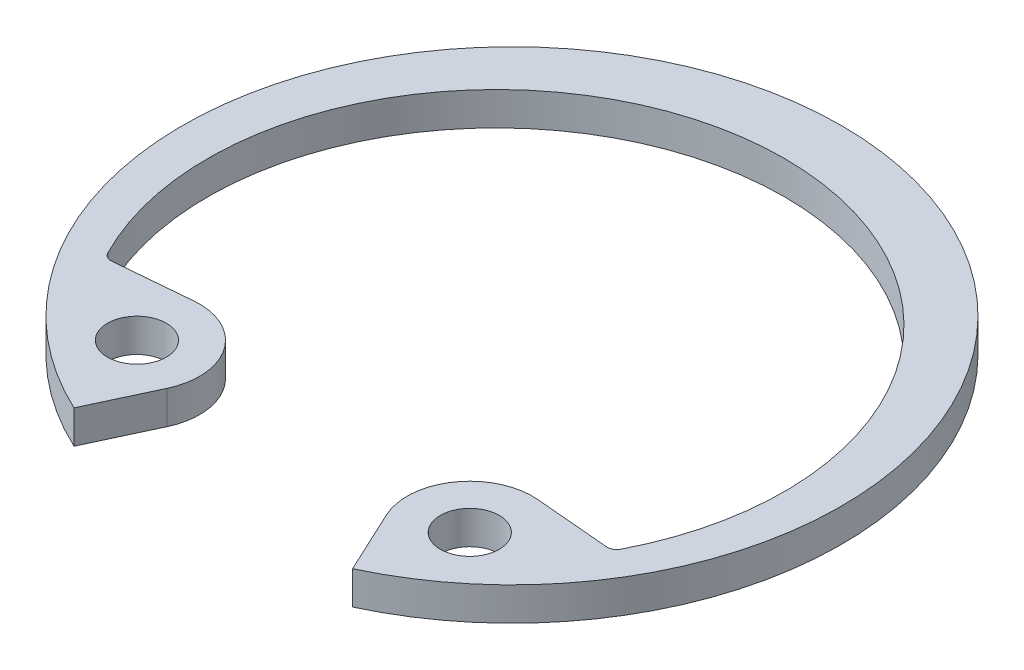
ISO-10303-21;
HEADER;
FILE_DESCRIPTION(('STEP AP214'),'2;1');
FILE_NAME('part.step','',(''),(''),'','','');
FILE_SCHEMA(('AUTOMOTIVE_DESIGN { 1 0 10303 214 1 1 1 1 }'));
ENDSEC;
DATA;
#1=APPLICATION_CONTEXT('core data for automotive mechanical design processes');
#2=APPLICATION_PROTOCOL_DEFINITION('international standard','automotive_design',2000,#1);
#3=PRODUCT_CONTEXT('',#1,'mechanical');
#4=PRODUCT('Part','Part','',(#3));
#5=PRODUCT_RELATED_PRODUCT_CATEGORY('part','',(#4));
#6=PRODUCT_DEFINITION_FORMATION('','',#4);
#7=PRODUCT_DEFINITION_CONTEXT('part definition',#1,'design');
#8=PRODUCT_DEFINITION('design','',#6,#7);
#9=PRODUCT_DEFINITION_SHAPE('','',#8);
#10=(LENGTH_UNIT() NAMED_UNIT(*) SI_UNIT(.MILLI.,.METRE.));
#11=(NAMED_UNIT(*) PLANE_ANGLE_UNIT() SI_UNIT($,.RADIAN.));
#12=(NAMED_UNIT(*) SI_UNIT($,.STERADIAN.) SOLID_ANGLE_UNIT());
#13=UNCERTAINTY_MEASURE_WITH_UNIT(LENGTH_MEASURE(1.E-05),#10,'distance_accuracy_value','');
#14=(GEOMETRIC_REPRESENTATION_CONTEXT(3) GLOBAL_UNCERTAINTY_ASSIGNED_CONTEXT((#13)) GLOBAL_UNIT_ASSIGNED_CONTEXT((#10,
#11,#12)) REPRESENTATION_CONTEXT('',''));
#15=CARTESIAN_POINT('',(0.,0.,0.));
#16=DIRECTION('',(0.,0.,1.));
#17=DIRECTION('',(1.,0.,0.));
#18=AXIS2_PLACEMENT_3D('',#15,#16,#17);
#19=CARTESIAN_POINT('',(4.45134772404972,-0.889,5.57924566582234));
#20=DIRECTION('',(0.,1.,0.));
#21=DIRECTION('',(0.,0.,1.));
#22=AXIS2_PLACEMENT_3D('',#19,#20,#21);
#23=CYLINDRICAL_SURFACE('',#22,1.6764);
#24=CARTESIAN_POINT('',(4.45134772404972,0.,5.57924566582234));
#25=DIRECTION('',(0.,1.,0.));
#26=DIRECTION('',(0.,0.,-1.));
#27=AXIS2_PLACEMENT_3D('',#24,#25,#26);
#28=CIRCLE('',#27,1.6764);
#29=CARTESIAN_POINT('',(4.5974556111919,0.,3.90922487394134));
#30=VERTEX_POINT('',#29);
#31=CARTESIAN_POINT('',(2.93201334986147,0.,6.28772291980444));
#32=VERTEX_POINT('',#31);
#33=EDGE_CURVE('E160',#30,#32,#28,.T.);
#34=ORIENTED_EDGE('',*,*,#33,.F.);
#35=DIRECTION('',(0.,1.,0.));
#36=VECTOR('',#35,1.);
#37=CARTESIAN_POINT('',(4.5974556111919,-0.889,3.90922487394134));
#38=LINE('',#37,#36);
#39=CARTESIAN_POINT('',(4.5974556111919,-0.889,3.90922487394134));
#40=VERTEX_POINT('',#39);
#41=EDGE_CURVE('E137',#40,#30,#38,.T.);
#42=ORIENTED_EDGE('',*,*,#41,.F.);
#43=CARTESIAN_POINT('',(4.45134772404972,-0.889,5.57924566582234));
#44=DIRECTION('',(0.,1.,0.));
#45=DIRECTION('',(0.,0.,-1.));
#46=AXIS2_PLACEMENT_3D('',#43,#44,#45);
#47=CIRCLE('',#46,1.6764);
#48=CARTESIAN_POINT('',(2.93201334986147,-0.889,6.28772291980444));
#49=VERTEX_POINT('',#48);
#50=EDGE_CURVE('E130',#40,#49,#47,.T.);
#51=ORIENTED_EDGE('',*,*,#50,.T.);
#52=DIRECTION('',(0.,1.,0.));
#53=VECTOR('',#52,1.);
#54=CARTESIAN_POINT('',(2.93201334986147,-0.889,6.28772291980444));
#55=LINE('',#54,#53);
#56=EDGE_CURVE('E113',#49,#32,#55,.T.);
#57=ORIENTED_EDGE('',*,*,#56,.T.);
#58=EDGE_LOOP('',(#34,#42,#51,#57));
#59=FACE_BOUND('',#58,.T.);
#60=ADVANCED_FACE('F38',(#59),#23,.T.);
#61=CARTESIAN_POINT('',(6.78158542453789,-0.889,4.10031147227811));
#62=DIRECTION('',(0.0871557427476615,0.,-0.996194698091745));
#63=DIRECTION('',(-0.996194698091745,0.,-0.0871557427476615));
#64=AXIS2_PLACEMENT_3D('',#61,#62,#63);
#65=PLANE('',#64);
#66=DIRECTION('',(-0.996194698091745,0.,-0.0871557427476615));
#67=VECTOR('',#66,1.);
#68=CARTESIAN_POINT('',(6.78158542453789,0.,4.10031147227811));
#69=LINE('',#68,#67);
#70=CARTESIAN_POINT('',(6.61356547813704,0.,4.0856116317218));
#71=VERTEX_POINT('',#70);
#72=EDGE_CURVE('E138',#71,#30,#69,.T.);
#73=ORIENTED_EDGE('',*,*,#72,.F.);
#74=DIRECTION('',(0.,-1.,0.));
#75=VECTOR('',#74,1.);
#76=CARTESIAN_POINT('',(6.61356547813704,-0.889,4.0856116317218));
#77=LINE('',#76,#75);
#78=CARTESIAN_POINT('',(6.61356547813704,-0.889,4.0856116317218));
#79=VERTEX_POINT('',#78);
#80=EDGE_CURVE('E53',#71,#79,#77,.T.);
#81=ORIENTED_EDGE('',*,*,#80,.T.);
#82=DIRECTION('',(-0.996194698091745,0.,-0.0871557427476615));
#83=VECTOR('',#82,1.);
#84=CARTESIAN_POINT('',(6.78158542453789,-0.889,4.10031147227811));
#85=LINE('',#84,#83);
#86=EDGE_CURVE('E124',#79,#40,#85,.T.);
#87=ORIENTED_EDGE('',*,*,#86,.T.);
#88=ORIENTED_EDGE('',*,*,#41,.T.);
#89=EDGE_LOOP('',(#73,#81,#87,#88));
#90=FACE_BOUND('',#89,.T.);
#91=ADVANCED_FACE('F215',(#90),#65,.T.);
#92=CARTESIAN_POINT('',(0.,-0.889,0.424107833514813));
#93=DIRECTION('',(0.,1.,0.));
#94=DIRECTION('',(0.,0.,1.));
#95=AXIS2_PLACEMENT_3D('',#92,#93,#94);
#96=CYLINDRICAL_SURFACE('',#95,7.71390783351481);
#97=CARTESIAN_POINT('',(0.,0.,0.424107833514813));
#98=DIRECTION('',(0.,-1.,0.));
#99=DIRECTION('',(0.,0.,1.));
#100=AXIS2_PLACEMENT_3D('',#97,#98,#99);
#101=CIRCLE('',#100,7.71390783351481);
#102=CARTESIAN_POINT('',(-6.86163995303587,0.,3.94863208777424));
#103=VERTEX_POINT('',#102);
#104=CARTESIAN_POINT('',(6.86163995303588,0.,3.94863208777425));
#105=VERTEX_POINT('',#104);
#106=EDGE_CURVE('E140',#103,#105,#101,.T.);
#107=ORIENTED_EDGE('',*,*,#106,.F.);
#108=DIRECTION('',(0.,1.,0.));
#109=VECTOR('',#108,1.);
#110=CARTESIAN_POINT('',(-6.86163995303587,-0.889,3.94863208777424));
#111=LINE('',#110,#109);
#112=CARTESIAN_POINT('',(-6.86163995303587,-0.889,3.94863208777424));
#113=VERTEX_POINT('',#112);
#114=EDGE_CURVE('E191',#103,#113,#111,.F.);
#115=ORIENTED_EDGE('',*,*,#114,.T.);
#116=CARTESIAN_POINT('',(0.,-0.889,0.424107833514813));
#117=DIRECTION('',(0.,-1.,0.));
#118=DIRECTION('',(0.,0.,1.));
#119=AXIS2_PLACEMENT_3D('',#116,#117,#118);
#120=CIRCLE('',#119,7.71390783351481);
#121=CARTESIAN_POINT('',(6.86163995303588,-0.889,3.94863208777425));
#122=VERTEX_POINT('',#121);
#123=EDGE_CURVE('E156',#113,#122,#120,.T.);
#124=ORIENTED_EDGE('',*,*,#123,.T.);
#125=DIRECTION('',(0.,1.,0.));
#126=VECTOR('',#125,1.);
#127=CARTESIAN_POINT('',(6.86163995303588,-0.889,3.94863208777425));
#128=LINE('',#127,#126);
#129=EDGE_CURVE('E188',#122,#105,#128,.T.);
#130=ORIENTED_EDGE('',*,*,#129,.T.);
#131=EDGE_LOOP('',(#107,#115,#124,#130));
#132=FACE_BOUND('',#131,.T.);
#133=ADVANCED_FACE('F211',(#132),#96,.F.);
#134=CARTESIAN_POINT('',(-6.78158542453788,-0.889,4.1003114722781));
#135=DIRECTION('',(-0.087155742747656,0.,-0.996194698091746));
#136=DIRECTION('',(-0.996194698091746,0.,0.087155742747656));
#137=AXIS2_PLACEMENT_3D('',#134,#135,#136);
#138=PLANE('',#137);
#139=DIRECTION('',(-0.996194698091746,0.,0.087155742747656));
#140=VECTOR('',#139,1.);
#141=CARTESIAN_POINT('',(-6.78158542453788,-0.889,4.1003114722781));
#142=LINE('',#141,#140);
#143=CARTESIAN_POINT('',(-4.59745561119189,-0.889,3.90922487394134));
#144=VERTEX_POINT('',#143);
#145=CARTESIAN_POINT('',(-6.61356547813703,-0.889,4.08561163172179));
#146=VERTEX_POINT('',#145);
#147=EDGE_CURVE('E153',#144,#146,#142,.T.);
#148=ORIENTED_EDGE('',*,*,#147,.T.);
#149=DIRECTION('',(0.,-1.,0.));
#150=VECTOR('',#149,1.);
#151=CARTESIAN_POINT('',(-6.61356547813703,0.,4.08561163172179));
#152=LINE('',#151,#150);
#153=CARTESIAN_POINT('',(-6.61356547813703,0.,4.08561163172179));
#154=VERTEX_POINT('',#153);
#155=EDGE_CURVE('E178',#146,#154,#152,.F.);
#156=ORIENTED_EDGE('',*,*,#155,.T.);
#157=DIRECTION('',(-0.996194698091746,0.,0.087155742747656));
#158=VECTOR('',#157,1.);
#159=CARTESIAN_POINT('',(-6.78158542453788,0.,4.1003114722781));
#160=LINE('',#159,#158);
#161=CARTESIAN_POINT('',(-4.59745561119189,0.,3.90922487394134));
#162=VERTEX_POINT('',#161);
#163=EDGE_CURVE('E173',#162,#154,#160,.T.);
#164=ORIENTED_EDGE('',*,*,#163,.F.);
#165=DIRECTION('',(0.,1.,0.));
#166=VECTOR('',#165,1.);
#167=CARTESIAN_POINT('',(-4.59745561119189,-0.889,3.90922487394134));
#168=LINE('',#167,#166);
#169=EDGE_CURVE('E179',#144,#162,#168,.T.);
#170=ORIENTED_EDGE('',*,*,#169,.F.);
#171=EDGE_LOOP('',(#148,#156,#164,#170));
#172=FACE_BOUND('',#171,.T.);
#173=ADVANCED_FACE('F205',(#172),#138,.T.);
#174=CARTESIAN_POINT('',(-4.45134772404972,-0.889,5.57924566582234));
#175=DIRECTION('',(0.,1.,0.));
#176=DIRECTION('',(0.,0.,1.));
#177=AXIS2_PLACEMENT_3D('',#174,#175,#176);
#178=CYLINDRICAL_SURFACE('',#177,1.6764);
#179=CARTESIAN_POINT('',(-4.45134772404972,0.,5.57924566582234));
#180=DIRECTION('',(0.,1.,0.));
#181=DIRECTION('',(0.,0.,1.));
#182=AXIS2_PLACEMENT_3D('',#179,#180,#181);
#183=CIRCLE('',#182,1.6764);
#184=CARTESIAN_POINT('',(-2.93201334986147,0.,6.28772291980444));
#185=VERTEX_POINT('',#184);
#186=EDGE_CURVE('E170',#185,#162,#183,.T.);
#187=ORIENTED_EDGE('',*,*,#186,.F.);
#188=DIRECTION('',(0.,1.,0.));
#189=VECTOR('',#188,1.);
#190=CARTESIAN_POINT('',(-2.93201334986147,-0.889,6.28772291980444));
#191=LINE('',#190,#189);
#192=CARTESIAN_POINT('',(-2.93201334986147,-0.889,6.28772291980444));
#193=VERTEX_POINT('',#192);
#194=EDGE_CURVE('E181',#193,#185,#191,.T.);
#195=ORIENTED_EDGE('',*,*,#194,.F.);
#196=CARTESIAN_POINT('',(-4.45134772404972,-0.889,5.57924566582234));
#197=DIRECTION('',(0.,1.,0.));
#198=DIRECTION('',(0.,0.,1.));
#199=AXIS2_PLACEMENT_3D('',#196,#197,#198);
#200=CIRCLE('',#199,1.6764);
#201=EDGE_CURVE('E150',#193,#144,#200,.T.);
#202=ORIENTED_EDGE('',*,*,#201,.T.);
#203=ORIENTED_EDGE('',*,*,#169,.T.);
#204=EDGE_LOOP('',(#187,#195,#202,#203));
#205=FACE_BOUND('',#204,.T.);
#206=ADVANCED_FACE('F224',(#205),#178,.T.);
#207=CARTESIAN_POINT('',(-3.72487283533013,-0.889,7.98801557338365));
#208=DIRECTION('',(0.906307787036653,0.,0.422618261740694));
#209=DIRECTION('',(0.422618261740694,0.,-0.906307787036653));
#210=AXIS2_PLACEMENT_3D('',#207,#208,#209);
#211=PLANE('',#210);
#212=DIRECTION('',(0.422618261740694,0.,-0.906307787036653));
#213=VECTOR('',#212,1.);
#214=CARTESIAN_POINT('',(-3.72487283533013,0.,7.98801557338365));
#215=LINE('',#214,#213);
#216=CARTESIAN_POINT('',(-3.72487283533013,0.,7.98801557338365));
#217=VERTEX_POINT('',#216);
#218=EDGE_CURVE('E167',#217,#185,#215,.T.);
#219=ORIENTED_EDGE('',*,*,#218,.F.);
#220=DIRECTION('',(0.,1.,0.));
#221=VECTOR('',#220,1.);
#222=CARTESIAN_POINT('',(-3.72487283533013,-0.889,7.98801557338365));
#223=LINE('',#222,#221);
#224=CARTESIAN_POINT('',(-3.72487283533013,-0.889,7.98801557338365));
#225=VERTEX_POINT('',#224);
#226=EDGE_CURVE('E183',#225,#217,#223,.T.);
#227=ORIENTED_EDGE('',*,*,#226,.F.);
#228=DIRECTION('',(0.422618261740694,0.,-0.906307787036653));
#229=VECTOR('',#228,1.);
#230=CARTESIAN_POINT('',(-3.72487283533013,-0.889,7.98801557338365));
#231=LINE('',#230,#229);
#232=EDGE_CURVE('E147',#225,#193,#231,.T.);
#233=ORIENTED_EDGE('',*,*,#232,.T.);
#234=ORIENTED_EDGE('',*,*,#194,.T.);
#235=EDGE_LOOP('',(#219,#227,#233,#234));
#236=FACE_BOUND('',#235,.T.);
#237=ADVANCED_FACE('F221',(#236),#211,.T.);
#238=CARTESIAN_POINT('',(0.,-0.889,0.));
#239=DIRECTION('',(0.,1.,0.));
#240=DIRECTION('',(0.,0.,1.));
#241=AXIS2_PLACEMENT_3D('',#238,#239,#240);
#242=CYLINDRICAL_SURFACE('',#241,8.8138);
#243=CARTESIAN_POINT('',(0.,0.,0.));
#244=DIRECTION('',(0.,1.,0.));
#245=DIRECTION('',(0.,0.,1.));
#246=AXIS2_PLACEMENT_3D('',#243,#244,#245);
#247=CIRCLE('',#246,8.8138);
#248=CARTESIAN_POINT('',(3.72487283533013,0.,7.98801557338365));
#249=VERTEX_POINT('',#248);
#250=EDGE_CURVE('E164',#249,#217,#247,.T.);
#251=ORIENTED_EDGE('',*,*,#250,.F.);
#252=DIRECTION('',(0.,1.,0.));
#253=VECTOR('',#252,1.);
#254=CARTESIAN_POINT('',(3.72487283533013,-0.889,7.98801557338365));
#255=LINE('',#254,#253);
#256=CARTESIAN_POINT('',(3.72487283533013,-0.889,7.98801557338365));
#257=VERTEX_POINT('',#256);
#258=EDGE_CURVE('E123',#257,#249,#255,.T.);
#259=ORIENTED_EDGE('',*,*,#258,.F.);
#260=CARTESIAN_POINT('',(0.,-0.889,0.));
#261=DIRECTION('',(0.,1.,0.));
#262=DIRECTION('',(0.,0.,1.));
#263=AXIS2_PLACEMENT_3D('',#260,#261,#262);
#264=CIRCLE('',#263,8.8138);
#265=EDGE_CURVE('E133',#257,#225,#264,.T.);
#266=ORIENTED_EDGE('',*,*,#265,.T.);
#267=ORIENTED_EDGE('',*,*,#226,.T.);
#268=EDGE_LOOP('',(#251,#259,#266,#267));
#269=FACE_BOUND('',#268,.T.);
#270=ADVANCED_FACE('F219',(#269),#242,.T.);
#271=CARTESIAN_POINT('',(3.72487283533013,-0.889,7.98801557338365));
#272=DIRECTION('',(-0.906307787036653,0.,0.422618261740694));
#273=DIRECTION('',(0.422618261740694,0.,0.906307787036653));
#274=AXIS2_PLACEMENT_3D('',#271,#272,#273);
#275=PLANE('',#274);
#276=DIRECTION('',(0.422618261740694,0.,0.906307787036653));
#277=VECTOR('',#276,1.);
#278=CARTESIAN_POINT('',(3.72487283533013,0.,7.98801557338365));
#279=LINE('',#278,#277);
#280=EDGE_CURVE('E118',#32,#249,#279,.T.);
#281=ORIENTED_EDGE('',*,*,#280,.F.);
#282=ORIENTED_EDGE('',*,*,#56,.F.);
#283=DIRECTION('',(0.422618261740694,0.,0.906307787036653));
#284=VECTOR('',#283,1.);
#285=CARTESIAN_POINT('',(3.72487283533013,-0.889,7.98801557338365));
#286=LINE('',#285,#284);
#287=EDGE_CURVE('E116',#49,#257,#286,.T.);
#288=ORIENTED_EDGE('',*,*,#287,.T.);
#289=ORIENTED_EDGE('',*,*,#258,.T.);
#290=EDGE_LOOP('',(#281,#282,#288,#289));
#291=FACE_BOUND('',#290,.T.);
#292=ADVANCED_FACE('F115',(#291),#275,.T.);
#293=CARTESIAN_POINT('',(4.45134772404972,-0.889,5.57924566582234));
#294=DIRECTION('',(0.,-1.,0.));
#295=DIRECTION('',(0.,0.,-1.));
#296=AXIS2_PLACEMENT_3D('',#293,#294,#295);
#297=PLANE('',#296);
#298=CARTESIAN_POINT('',(-4.45134772404972,-0.889,5.57924566582234));
#299=DIRECTION('',(0.,1.,0.));
#300=DIRECTION('',(0.,0.,1.));
#301=AXIS2_PLACEMENT_3D('',#298,#299,#300);
#302=CIRCLE('',#301,0.7874);
#303=CARTESIAN_POINT('',(-4.45134772404972,-0.889,6.36664566582234));
#304=VERTEX_POINT('',#303);
#305=EDGE_CURVE('E369',#304,#304,#302,.T.);
#306=ORIENTED_EDGE('',*,*,#305,.T.);
#307=EDGE_LOOP('',(#306));
#308=FACE_BOUND('',#307,.T.);
#309=CARTESIAN_POINT('',(4.45134772404972,-0.889,5.57924566582234));
#310=DIRECTION('',(0.,1.,0.));
#311=DIRECTION('',(0.,0.,1.));
#312=AXIS2_PLACEMENT_3D('',#309,#310,#311);
#313=CIRCLE('',#312,0.7874);
#314=CARTESIAN_POINT('',(4.45134772404972,-0.889,6.36664566582234));
#315=VERTEX_POINT('',#314);
#316=EDGE_CURVE('E162',#315,#315,#313,.T.);
#317=ORIENTED_EDGE('',*,*,#316,.T.);
#318=EDGE_LOOP('',(#317));
#319=FACE_BOUND('',#318,.T.);
#320=ORIENTED_EDGE('',*,*,#50,.F.);
#321=ORIENTED_EDGE('',*,*,#86,.F.);
#322=CARTESIAN_POINT('',(6.63570303679495,-0.889,3.8325781784065));
#323=DIRECTION('',(0.,-1.,0.));
#324=DIRECTION('',(0.,0.,-1.));
#325=AXIS2_PLACEMENT_3D('',#322,#323,#324);
#326=CIRCLE('',#325,0.254);
#327=EDGE_CURVE('E11',#79,#122,#326,.F.);
#328=ORIENTED_EDGE('',*,*,#327,.T.);
#329=ORIENTED_EDGE('',*,*,#123,.F.);
#330=CARTESIAN_POINT('',(-6.63570303679494,-0.889,3.83257817840649));
#331=DIRECTION('',(0.,-1.,0.));
#332=DIRECTION('',(0.,0.,-1.));
#333=AXIS2_PLACEMENT_3D('',#330,#331,#332);
#334=CIRCLE('',#333,0.254);
#335=EDGE_CURVE('E196',#113,#146,#334,.F.);
#336=ORIENTED_EDGE('',*,*,#335,.T.);
#337=ORIENTED_EDGE('',*,*,#147,.F.);
#338=ORIENTED_EDGE('',*,*,#201,.F.);
#339=ORIENTED_EDGE('',*,*,#232,.F.);
#340=ORIENTED_EDGE('',*,*,#265,.F.);
#341=ORIENTED_EDGE('',*,*,#287,.F.);
#342=EDGE_LOOP('',(#320,#321,#328,#329,#336,#337,#338,#339,#340,#341));
#343=FACE_BOUND('',#342,.T.);
#344=ADVANCED_FACE('F129',(#308,#319,#343),#297,.T.);
#345=CARTESIAN_POINT('',(4.45134772404972,0.,5.57924566582234));
#346=DIRECTION('',(0.,-1.,0.));
#347=DIRECTION('',(0.,0.,-1.));
#348=AXIS2_PLACEMENT_3D('',#345,#346,#347);
#349=PLANE('',#348);
#350=CARTESIAN_POINT('',(-4.45134772404972,0.,5.57924566582234));
#351=DIRECTION('',(0.,1.,0.));
#352=DIRECTION('',(0.,0.,1.));
#353=AXIS2_PLACEMENT_3D('',#350,#351,#352);
#354=CIRCLE('',#353,0.7874);
#355=CARTESIAN_POINT('',(-4.45134772404972,0.,6.36664566582234));
#356=VERTEX_POINT('',#355);
#357=EDGE_CURVE('E365',#356,#356,#354,.T.);
#358=ORIENTED_EDGE('',*,*,#357,.F.);
#359=EDGE_LOOP('',(#358));
#360=FACE_BOUND('',#359,.T.);
#361=CARTESIAN_POINT('',(4.45134772404972,0.,5.57924566582234));
#362=DIRECTION('',(0.,1.,0.));
#363=DIRECTION('',(0.,0.,1.));
#364=AXIS2_PLACEMENT_3D('',#361,#362,#363);
#365=CIRCLE('',#364,0.7874);
#366=CARTESIAN_POINT('',(4.45134772404972,0.,6.36664566582234));
#367=VERTEX_POINT('',#366);
#368=EDGE_CURVE('E143',#367,#367,#365,.T.);
#369=ORIENTED_EDGE('',*,*,#368,.F.);
#370=EDGE_LOOP('',(#369));
#371=FACE_BOUND('',#370,.T.);
#372=ORIENTED_EDGE('',*,*,#33,.T.);
#373=ORIENTED_EDGE('',*,*,#280,.T.);
#374=ORIENTED_EDGE('',*,*,#250,.T.);
#375=ORIENTED_EDGE('',*,*,#218,.T.);
#376=ORIENTED_EDGE('',*,*,#186,.T.);
#377=ORIENTED_EDGE('',*,*,#163,.T.);
#378=CARTESIAN_POINT('',(-6.63570303679494,0.,3.83257817840649));
#379=DIRECTION('',(0.,-1.,0.));
#380=DIRECTION('',(0.,0.,-1.));
#381=AXIS2_PLACEMENT_3D('',#378,#379,#380);
#382=CIRCLE('',#381,0.254);
#383=EDGE_CURVE('E194',#154,#103,#382,.T.);
#384=ORIENTED_EDGE('',*,*,#383,.T.);
#385=ORIENTED_EDGE('',*,*,#106,.T.);
#386=CARTESIAN_POINT('',(6.63570303679495,0.,3.8325781784065));
#387=DIRECTION('',(0.,-1.,0.));
#388=DIRECTION('',(0.,0.,-1.));
#389=AXIS2_PLACEMENT_3D('',#386,#387,#388);
#390=CIRCLE('',#389,0.254);
#391=EDGE_CURVE('E46',#105,#71,#390,.T.);
#392=ORIENTED_EDGE('',*,*,#391,.T.);
#393=ORIENTED_EDGE('',*,*,#72,.T.);
#394=EDGE_LOOP('',(#372,#373,#374,#375,#376,#377,#384,#385,#392,#393));
#395=FACE_BOUND('',#394,.T.);
#396=ADVANCED_FACE('F209',(#360,#371,#395),#349,.F.);
#397=CARTESIAN_POINT('',(4.45134772404972,-0.889,5.57924566582234));
#398=DIRECTION('',(0.,1.,0.));
#399=DIRECTION('',(0.,0.,1.));
#400=AXIS2_PLACEMENT_3D('',#397,#398,#399);
#401=CYLINDRICAL_SURFACE('',#400,0.7874);
#402=ORIENTED_EDGE('',*,*,#316,.F.);
#403=EDGE_LOOP('',(#402));
#404=FACE_BOUND('',#403,.T.);
#405=ORIENTED_EDGE('',*,*,#368,.T.);
#406=EDGE_LOOP('',(#405));
#407=FACE_BOUND('',#406,.T.);
#408=ADVANCED_FACE('F247',(#404,#407),#401,.F.);
#409=CARTESIAN_POINT('',(-4.45134772404972,-0.889,5.57924566582234));
#410=DIRECTION('',(0.,1.,0.));
#411=DIRECTION('',(0.,0.,1.));
#412=AXIS2_PLACEMENT_3D('',#409,#410,#411);
#413=CYLINDRICAL_SURFACE('',#412,0.7874);
#414=ORIENTED_EDGE('',*,*,#305,.F.);
#415=EDGE_LOOP('',(#414));
#416=FACE_BOUND('',#415,.T.);
#417=ORIENTED_EDGE('',*,*,#357,.T.);
#418=EDGE_LOOP('',(#417));
#419=FACE_BOUND('',#418,.T.);
#420=ADVANCED_FACE('F242',(#416,#419),#413,.F.);
#421=CARTESIAN_POINT('',(-6.63570303679494,-0.889,3.83257817840649));
#422=DIRECTION('',(0.,1.,0.));
#423=DIRECTION('',(0.,0.,1.));
#424=AXIS2_PLACEMENT_3D('',#421,#422,#423);
#425=CYLINDRICAL_SURFACE('',#424,0.254);
#426=ORIENTED_EDGE('',*,*,#335,.F.);
#427=ORIENTED_EDGE('',*,*,#114,.F.);
#428=ORIENTED_EDGE('',*,*,#383,.F.);
#429=ORIENTED_EDGE('',*,*,#155,.F.);
#430=EDGE_LOOP('',(#426,#427,#428,#429));
#431=FACE_BOUND('',#430,.T.);
#432=ADVANCED_FACE('F207',(#431),#425,.F.);
#433=CARTESIAN_POINT('',(6.63570303679495,-0.889,3.8325781784065));
#434=DIRECTION('',(0.,1.,0.));
#435=DIRECTION('',(0.,0.,1.));
#436=AXIS2_PLACEMENT_3D('',#433,#434,#435);
#437=CYLINDRICAL_SURFACE('',#436,0.254);
#438=ORIENTED_EDGE('',*,*,#327,.F.);
#439=ORIENTED_EDGE('',*,*,#80,.F.);
#440=ORIENTED_EDGE('',*,*,#391,.F.);
#441=ORIENTED_EDGE('',*,*,#129,.F.);
#442=EDGE_LOOP('',(#438,#439,#440,#441));
#443=FACE_BOUND('',#442,.T.);
#444=ADVANCED_FACE('F40',(#443),#437,.F.);
#445=CLOSED_SHELL('',(#60,#91,#133,#173,#206,#237,#270,#292,#344,#396,#408,#420,#432,#444));
#446=MANIFOLD_SOLID_BREP('B2',#445);
#447=ADVANCED_BREP_SHAPE_REPRESENTATION('',(#18,#446),#14);
#448=SHAPE_DEFINITION_REPRESENTATION(#9,#447);
ENDSEC;
END-ISO-10303-21;
